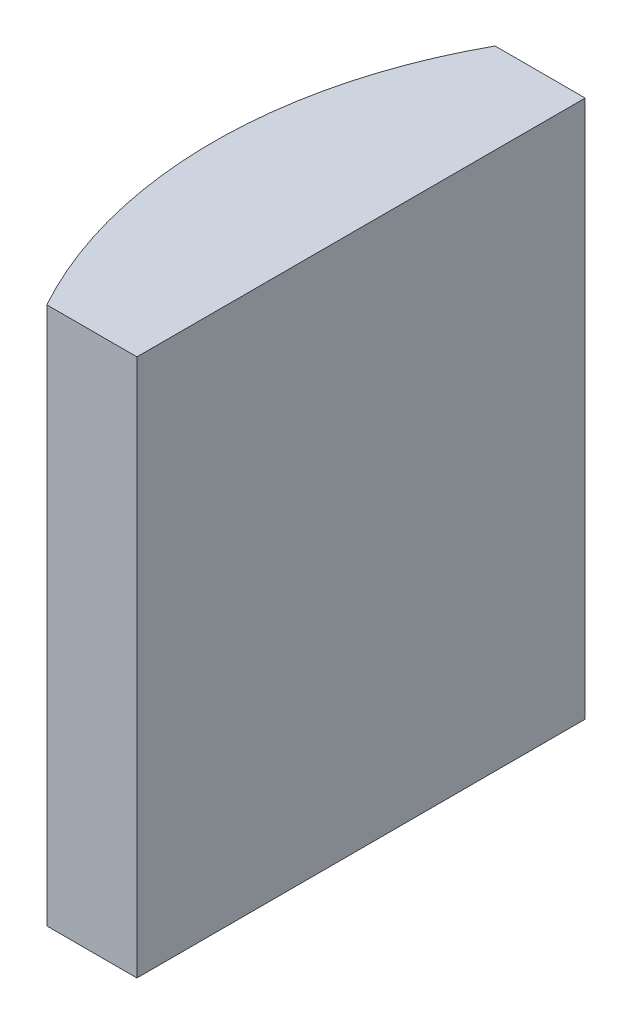
ISO-10303-21;
HEADER;
FILE_DESCRIPTION(('STEP AP214'),'2;1');
FILE_NAME('part.step','',(''),(''),'','','');
FILE_SCHEMA(('AUTOMOTIVE_DESIGN { 1 0 10303 214 1 1 1 1 }'));
ENDSEC;
DATA;
#1=APPLICATION_CONTEXT('core data for automotive mechanical design processes');
#2=APPLICATION_PROTOCOL_DEFINITION('international standard','automotive_design',2000,#1);
#3=PRODUCT_CONTEXT('',#1,'mechanical');
#4=PRODUCT('Part','Part','',(#3));
#5=PRODUCT_RELATED_PRODUCT_CATEGORY('part','',(#4));
#6=PRODUCT_DEFINITION_FORMATION('','',#4);
#7=PRODUCT_DEFINITION_CONTEXT('part definition',#1,'design');
#8=PRODUCT_DEFINITION('design','',#6,#7);
#9=PRODUCT_DEFINITION_SHAPE('','',#8);
#10=(LENGTH_UNIT() NAMED_UNIT(*) SI_UNIT(.MILLI.,.METRE.));
#11=(NAMED_UNIT(*) PLANE_ANGLE_UNIT() SI_UNIT($,.RADIAN.));
#12=(NAMED_UNIT(*) SI_UNIT($,.STERADIAN.) SOLID_ANGLE_UNIT());
#13=UNCERTAINTY_MEASURE_WITH_UNIT(LENGTH_MEASURE(1.E-05),#10,'distance_accuracy_value','');
#14=(GEOMETRIC_REPRESENTATION_CONTEXT(3) GLOBAL_UNCERTAINTY_ASSIGNED_CONTEXT((#13)) GLOBAL_UNIT_ASSIGNED_CONTEXT((#10,
#11,#12)) REPRESENTATION_CONTEXT('',''));
#15=CARTESIAN_POINT('',(0.,0.,0.));
#16=DIRECTION('',(0.,0.,1.));
#17=DIRECTION('',(1.,0.,0.));
#18=AXIS2_PLACEMENT_3D('',#15,#16,#17);
#19=CARTESIAN_POINT('',(4.35520433485127,12.,0.));
#20=DIRECTION('',(0.,-1.,0.));
#21=DIRECTION('',(0.,0.,-1.));
#22=AXIS2_PLACEMENT_3D('',#19,#20,#21);
#23=CYLINDRICAL_SURFACE('',#22,10.34);
#24=CARTESIAN_POINT('',(4.35520433485127,0.,0.));
#25=DIRECTION('',(0.,1.,0.));
#26=DIRECTION('',(0.,0.,1.));
#27=AXIS2_PLACEMENT_3D('',#24,#25,#26);
#28=CIRCLE('',#27,10.34);
#29=CARTESIAN_POINT('',(-4.69551939311657,0.,-5.));
#30=VERTEX_POINT('',#29);
#31=CARTESIAN_POINT('',(-4.69551939311657,0.,5.));
#32=VERTEX_POINT('',#31);
#33=EDGE_CURVE('E100',#30,#32,#28,.T.);
#34=ORIENTED_EDGE('',*,*,#33,.T.);
#35=DIRECTION('',(0.,-1.,0.));
#36=VECTOR('',#35,1.);
#37=CARTESIAN_POINT('',(-4.69551939311657,12.,5.));
#38=LINE('',#37,#36);
#39=CARTESIAN_POINT('',(-4.69551939311657,12.,5.));
#40=VERTEX_POINT('',#39);
#41=EDGE_CURVE('E11',#40,#32,#38,.T.);
#42=ORIENTED_EDGE('',*,*,#41,.F.);
#43=CARTESIAN_POINT('',(4.35520433485127,12.,0.));
#44=DIRECTION('',(0.,1.,0.));
#45=DIRECTION('',(0.,0.,1.));
#46=AXIS2_PLACEMENT_3D('',#43,#44,#45);
#47=CIRCLE('',#46,10.34);
#48=CARTESIAN_POINT('',(-4.69551939311657,12.,-5.));
#49=VERTEX_POINT('',#48);
#50=EDGE_CURVE('E88',#49,#40,#47,.T.);
#51=ORIENTED_EDGE('',*,*,#50,.F.);
#52=DIRECTION('',(0.,-1.,0.));
#53=VECTOR('',#52,1.);
#54=CARTESIAN_POINT('',(-4.69551939311657,12.,-5.));
#55=LINE('',#54,#53);
#56=EDGE_CURVE('E96',#49,#30,#55,.T.);
#57=ORIENTED_EDGE('',*,*,#56,.T.);
#58=EDGE_LOOP('',(#34,#42,#51,#57));
#59=FACE_BOUND('',#58,.T.);
#60=ADVANCED_FACE('F37',(#59),#23,.T.);
#61=CARTESIAN_POINT('',(-4.69551939311657,12.,5.));
#62=DIRECTION('',(0.,0.,-1.));
#63=DIRECTION('',(-1.,0.,0.));
#64=AXIS2_PLACEMENT_3D('',#61,#62,#63);
#65=PLANE('',#64);
#66=DIRECTION('',(1.,0.,0.));
#67=VECTOR('',#66,1.);
#68=CARTESIAN_POINT('',(-4.69551939311657,0.,5.));
#69=LINE('',#68,#67);
#70=CARTESIAN_POINT('',(-2.68479566514873,0.,5.));
#71=VERTEX_POINT('',#70);
#72=EDGE_CURVE('E92',#32,#71,#69,.T.);
#73=ORIENTED_EDGE('',*,*,#72,.T.);
#74=DIRECTION('',(0.,-1.,0.));
#75=VECTOR('',#74,1.);
#76=CARTESIAN_POINT('',(-2.68479566514873,12.,5.));
#77=LINE('',#76,#75);
#78=CARTESIAN_POINT('',(-2.68479566514873,12.,5.));
#79=VERTEX_POINT('',#78);
#80=EDGE_CURVE('E45',#79,#71,#77,.T.);
#81=ORIENTED_EDGE('',*,*,#80,.F.);
#82=DIRECTION('',(1.,0.,0.));
#83=VECTOR('',#82,1.);
#84=CARTESIAN_POINT('',(-4.69551939311657,12.,5.));
#85=LINE('',#84,#83);
#86=EDGE_CURVE('E83',#40,#79,#85,.T.);
#87=ORIENTED_EDGE('',*,*,#86,.F.);
#88=ORIENTED_EDGE('',*,*,#41,.T.);
#89=EDGE_LOOP('',(#73,#81,#87,#88));
#90=FACE_BOUND('',#89,.T.);
#91=ADVANCED_FACE('F91',(#90),#65,.F.);
#92=CARTESIAN_POINT('',(-2.68479566514874,12.,-5.));
#93=DIRECTION('',(-1.,0.,0.));
#94=DIRECTION('',(0.,0.,1.));
#95=AXIS2_PLACEMENT_3D('',#92,#93,#94);
#96=PLANE('',#95);
#97=DIRECTION('',(0.,0.,-1.));
#98=VECTOR('',#97,1.);
#99=CARTESIAN_POINT('',(-2.68479566514874,0.,-5.));
#100=LINE('',#99,#98);
#101=CARTESIAN_POINT('',(-2.68479566514874,0.,-5.));
#102=VERTEX_POINT('',#101);
#103=EDGE_CURVE('E70',#71,#102,#100,.T.);
#104=ORIENTED_EDGE('',*,*,#103,.T.);
#105=DIRECTION('',(0.,-1.,0.));
#106=VECTOR('',#105,1.);
#107=CARTESIAN_POINT('',(-2.68479566514874,12.,-5.));
#108=LINE('',#107,#106);
#109=CARTESIAN_POINT('',(-2.68479566514874,12.,-5.));
#110=VERTEX_POINT('',#109);
#111=EDGE_CURVE('E93',#110,#102,#108,.T.);
#112=ORIENTED_EDGE('',*,*,#111,.F.);
#113=DIRECTION('',(0.,0.,-1.));
#114=VECTOR('',#113,1.);
#115=CARTESIAN_POINT('',(-2.68479566514874,12.,-5.));
#116=LINE('',#115,#114);
#117=EDGE_CURVE('E86',#79,#110,#116,.T.);
#118=ORIENTED_EDGE('',*,*,#117,.F.);
#119=ORIENTED_EDGE('',*,*,#80,.T.);
#120=EDGE_LOOP('',(#104,#112,#118,#119));
#121=FACE_BOUND('',#120,.T.);
#122=ADVANCED_FACE('F94',(#121),#96,.F.);
#123=CARTESIAN_POINT('',(-4.69551939311657,12.,-5.));
#124=DIRECTION('',(0.,0.,1.));
#125=DIRECTION('',(1.,0.,0.));
#126=AXIS2_PLACEMENT_3D('',#123,#124,#125);
#127=PLANE('',#126);
#128=DIRECTION('',(-1.,0.,0.));
#129=VECTOR('',#128,1.);
#130=CARTESIAN_POINT('',(-4.69551939311657,0.,-5.));
#131=LINE('',#130,#129);
#132=EDGE_CURVE('E76',#102,#30,#131,.T.);
#133=ORIENTED_EDGE('',*,*,#132,.T.);
#134=ORIENTED_EDGE('',*,*,#56,.F.);
#135=DIRECTION('',(-1.,0.,0.));
#136=VECTOR('',#135,1.);
#137=CARTESIAN_POINT('',(-4.69551939311657,12.,-5.));
#138=LINE('',#137,#136);
#139=EDGE_CURVE('E53',#110,#49,#138,.T.);
#140=ORIENTED_EDGE('',*,*,#139,.F.);
#141=ORIENTED_EDGE('',*,*,#111,.T.);
#142=EDGE_LOOP('',(#133,#134,#140,#141));
#143=FACE_BOUND('',#142,.T.);
#144=ADVANCED_FACE('F107',(#143),#127,.F.);
#145=CARTESIAN_POINT('',(4.35520433485127,12.,0.));
#146=DIRECTION('',(0.,1.,0.));
#147=DIRECTION('',(0.,0.,1.));
#148=AXIS2_PLACEMENT_3D('',#145,#146,#147);
#149=PLANE('',#148);
#150=ORIENTED_EDGE('',*,*,#50,.T.);
#151=ORIENTED_EDGE('',*,*,#86,.T.);
#152=ORIENTED_EDGE('',*,*,#117,.T.);
#153=ORIENTED_EDGE('',*,*,#139,.T.);
#154=EDGE_LOOP('',(#150,#151,#152,#153));
#155=FACE_BOUND('',#154,.T.);
#156=ADVANCED_FACE('F84',(#155),#149,.T.);
#157=CARTESIAN_POINT('',(4.35520433485127,0.,0.));
#158=DIRECTION('',(0.,1.,0.));
#159=DIRECTION('',(0.,0.,1.));
#160=AXIS2_PLACEMENT_3D('',#157,#158,#159);
#161=PLANE('',#160);
#162=ORIENTED_EDGE('',*,*,#33,.F.);
#163=ORIENTED_EDGE('',*,*,#132,.F.);
#164=ORIENTED_EDGE('',*,*,#103,.F.);
#165=ORIENTED_EDGE('',*,*,#72,.F.);
#166=EDGE_LOOP('',(#162,#163,#164,#165));
#167=FACE_BOUND('',#166,.T.);
#168=ADVANCED_FACE('F110',(#167),#161,.F.);
#169=CLOSED_SHELL('',(#60,#91,#122,#144,#156,#168));
#170=MANIFOLD_SOLID_BREP('B2',#169);
#171=ADVANCED_BREP_SHAPE_REPRESENTATION('',(#18,#170),#14);
#172=SHAPE_DEFINITION_REPRESENTATION(#9,#171);
ENDSEC;
END-ISO-10303-21;
